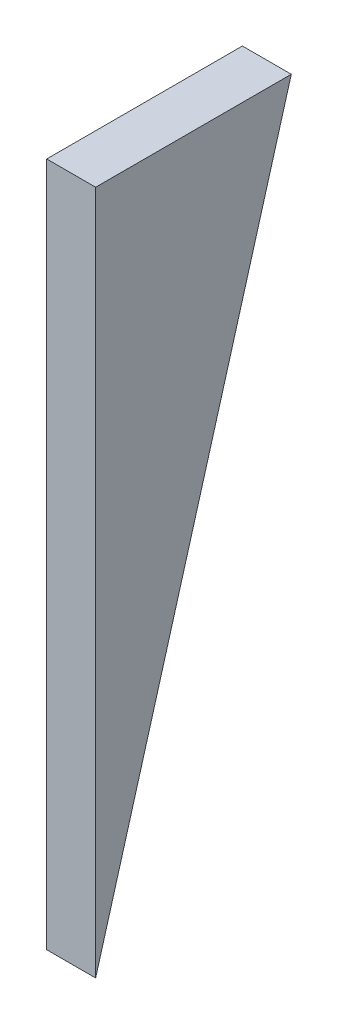
ISO-10303-21;
HEADER;
FILE_DESCRIPTION(('STEP AP214'),'2;1');
FILE_NAME('part.step','',(''),(''),'','','');
FILE_SCHEMA(('AUTOMOTIVE_DESIGN { 1 0 10303 214 1 1 1 1 }'));
ENDSEC;
DATA;
#1=APPLICATION_CONTEXT('core data for automotive mechanical design processes');
#2=APPLICATION_PROTOCOL_DEFINITION('international standard','automotive_design',2000,#1);
#3=PRODUCT_CONTEXT('',#1,'mechanical');
#4=PRODUCT('Part','Part','',(#3));
#5=PRODUCT_RELATED_PRODUCT_CATEGORY('part','',(#4));
#6=PRODUCT_DEFINITION_FORMATION('','',#4);
#7=PRODUCT_DEFINITION_CONTEXT('part definition',#1,'design');
#8=PRODUCT_DEFINITION('design','',#6,#7);
#9=PRODUCT_DEFINITION_SHAPE('','',#8);
#10=(LENGTH_UNIT() NAMED_UNIT(*) SI_UNIT(.MILLI.,.METRE.));
#11=(NAMED_UNIT(*) PLANE_ANGLE_UNIT() SI_UNIT($,.RADIAN.));
#12=(NAMED_UNIT(*) SI_UNIT($,.STERADIAN.) SOLID_ANGLE_UNIT());
#13=UNCERTAINTY_MEASURE_WITH_UNIT(LENGTH_MEASURE(1.E-05),#10,'distance_accuracy_value','');
#14=(GEOMETRIC_REPRESENTATION_CONTEXT(3) GLOBAL_UNCERTAINTY_ASSIGNED_CONTEXT((#13)) GLOBAL_UNIT_ASSIGNED_CONTEXT((#10,
#11,#12)) REPRESENTATION_CONTEXT('',''));
#15=CARTESIAN_POINT('',(0.,0.,0.));
#16=DIRECTION('',(0.,0.,1.));
#17=DIRECTION('',(1.,0.,0.));
#18=AXIS2_PLACEMENT_3D('',#15,#16,#17);
#19=CARTESIAN_POINT('',(6.35,88.9,0.));
#20=DIRECTION('',(0.,0.,-1.));
#21=DIRECTION('',(-1.,0.,0.));
#22=AXIS2_PLACEMENT_3D('',#19,#20,#21);
#23=PLANE('',#22);
#24=DIRECTION('',(0.,-1.,0.));
#25=VECTOR('',#24,1.);
#26=CARTESIAN_POINT('',(-6.35,88.9,0.));
#27=LINE('',#26,#25);
#28=CARTESIAN_POINT('',(-6.35,88.9,0.));
#29=VERTEX_POINT('',#28);
#30=CARTESIAN_POINT('',(-6.35,-88.9,0.));
#31=VERTEX_POINT('',#30);
#32=EDGE_CURVE('E95',#29,#31,#27,.T.);
#33=ORIENTED_EDGE('',*,*,#32,.T.);
#34=DIRECTION('',(-1.,0.,0.));
#35=VECTOR('',#34,1.);
#36=CARTESIAN_POINT('',(6.35,-88.9,0.));
#37=LINE('',#36,#35);
#38=CARTESIAN_POINT('',(6.35,-88.9,0.));
#39=VERTEX_POINT('',#38);
#40=EDGE_CURVE('E11',#39,#31,#37,.T.);
#41=ORIENTED_EDGE('',*,*,#40,.F.);
#42=DIRECTION('',(0.,-1.,0.));
#43=VECTOR('',#42,1.);
#44=CARTESIAN_POINT('',(6.35,88.9,0.));
#45=LINE('',#44,#43);
#46=CARTESIAN_POINT('',(6.35,88.9,0.));
#47=VERTEX_POINT('',#46);
#48=EDGE_CURVE('E87',#47,#39,#45,.T.);
#49=ORIENTED_EDGE('',*,*,#48,.F.);
#50=DIRECTION('',(-1.,0.,0.));
#51=VECTOR('',#50,1.);
#52=CARTESIAN_POINT('',(6.35,88.9,0.));
#53=LINE('',#52,#51);
#54=EDGE_CURVE('E96',#47,#29,#53,.T.);
#55=ORIENTED_EDGE('',*,*,#54,.T.);
#56=EDGE_LOOP('',(#33,#41,#49,#55));
#57=FACE_BOUND('',#56,.T.);
#58=ADVANCED_FACE('F45',(#57),#23,.F.);
#59=CARTESIAN_POINT('',(6.35,88.9,-50.8));
#60=DIRECTION('',(0.,0.274721127897378,0.961523947640823));
#61=DIRECTION('',(0.,-0.961523947640823,0.274721127897378));
#62=AXIS2_PLACEMENT_3D('',#59,#60,#61);
#63=PLANE('',#62);
#64=DIRECTION('',(0.,0.961523947640823,-0.274721127897378));
#65=VECTOR('',#64,1.);
#66=CARTESIAN_POINT('',(-6.35,88.9,-50.8));
#67=LINE('',#66,#65);
#68=CARTESIAN_POINT('',(-6.35,88.9,-50.8));
#69=VERTEX_POINT('',#68);
#70=EDGE_CURVE('E74',#31,#69,#67,.T.);
#71=ORIENTED_EDGE('',*,*,#70,.T.);
#72=DIRECTION('',(-1.,0.,0.));
#73=VECTOR('',#72,1.);
#74=CARTESIAN_POINT('',(6.35,88.9,-50.8));
#75=LINE('',#74,#73);
#76=CARTESIAN_POINT('',(6.35,88.9,-50.8));
#77=VERTEX_POINT('',#76);
#78=EDGE_CURVE('E54',#77,#69,#75,.T.);
#79=ORIENTED_EDGE('',*,*,#78,.F.);
#80=DIRECTION('',(0.,0.961523947640823,-0.274721127897378));
#81=VECTOR('',#80,1.);
#82=CARTESIAN_POINT('',(6.35,88.9,-50.8));
#83=LINE('',#82,#81);
#84=EDGE_CURVE('E82',#39,#77,#83,.T.);
#85=ORIENTED_EDGE('',*,*,#84,.F.);
#86=ORIENTED_EDGE('',*,*,#40,.T.);
#87=EDGE_LOOP('',(#71,#79,#85,#86));
#88=FACE_BOUND('',#87,.T.);
#89=ADVANCED_FACE('F83',(#88),#63,.F.);
#90=CARTESIAN_POINT('',(6.35,88.9,0.));
#91=DIRECTION('',(0.,-1.,0.));
#92=DIRECTION('',(0.,0.,-1.));
#93=AXIS2_PLACEMENT_3D('',#90,#91,#92);
#94=PLANE('',#93);
#95=DIRECTION('',(0.,0.,1.));
#96=VECTOR('',#95,1.);
#97=CARTESIAN_POINT('',(-6.35,88.9,0.));
#98=LINE('',#97,#96);
#99=EDGE_CURVE('E79',#69,#29,#98,.T.);
#100=ORIENTED_EDGE('',*,*,#99,.T.);
#101=ORIENTED_EDGE('',*,*,#54,.F.);
#102=DIRECTION('',(0.,0.,1.));
#103=VECTOR('',#102,1.);
#104=CARTESIAN_POINT('',(6.35,88.9,0.));
#105=LINE('',#104,#103);
#106=EDGE_CURVE('E62',#77,#47,#105,.T.);
#107=ORIENTED_EDGE('',*,*,#106,.F.);
#108=ORIENTED_EDGE('',*,*,#78,.T.);
#109=EDGE_LOOP('',(#100,#101,#107,#108));
#110=FACE_BOUND('',#109,.T.);
#111=ADVANCED_FACE('F108',(#110),#94,.F.);
#112=CARTESIAN_POINT('',(6.35,0.,0.));
#113=DIRECTION('',(1.,0.,0.));
#114=DIRECTION('',(0.,0.,-1.));
#115=AXIS2_PLACEMENT_3D('',#112,#113,#114);
#116=PLANE('',#115);
#117=ORIENTED_EDGE('',*,*,#48,.T.);
#118=ORIENTED_EDGE('',*,*,#84,.T.);
#119=ORIENTED_EDGE('',*,*,#106,.T.);
#120=EDGE_LOOP('',(#117,#118,#119));
#121=FACE_BOUND('',#120,.T.);
#122=ADVANCED_FACE('F90',(#121),#116,.T.);
#123=CARTESIAN_POINT('',(-6.35,0.,0.));
#124=DIRECTION('',(1.,0.,0.));
#125=DIRECTION('',(0.,0.,-1.));
#126=AXIS2_PLACEMENT_3D('',#123,#124,#125);
#127=PLANE('',#126);
#128=ORIENTED_EDGE('',*,*,#32,.F.);
#129=ORIENTED_EDGE('',*,*,#99,.F.);
#130=ORIENTED_EDGE('',*,*,#70,.F.);
#131=EDGE_LOOP('',(#128,#129,#130));
#132=FACE_BOUND('',#131,.T.);
#133=ADVANCED_FACE('F109',(#132),#127,.F.);
#134=CLOSED_SHELL('',(#58,#89,#111,#122,#133));
#135=MANIFOLD_SOLID_BREP('B2',#134);
#136=ADVANCED_BREP_SHAPE_REPRESENTATION('',(#18,#135),#14);
#137=SHAPE_DEFINITION_REPRESENTATION(#9,#136);
ENDSEC;
END-ISO-10303-21;
